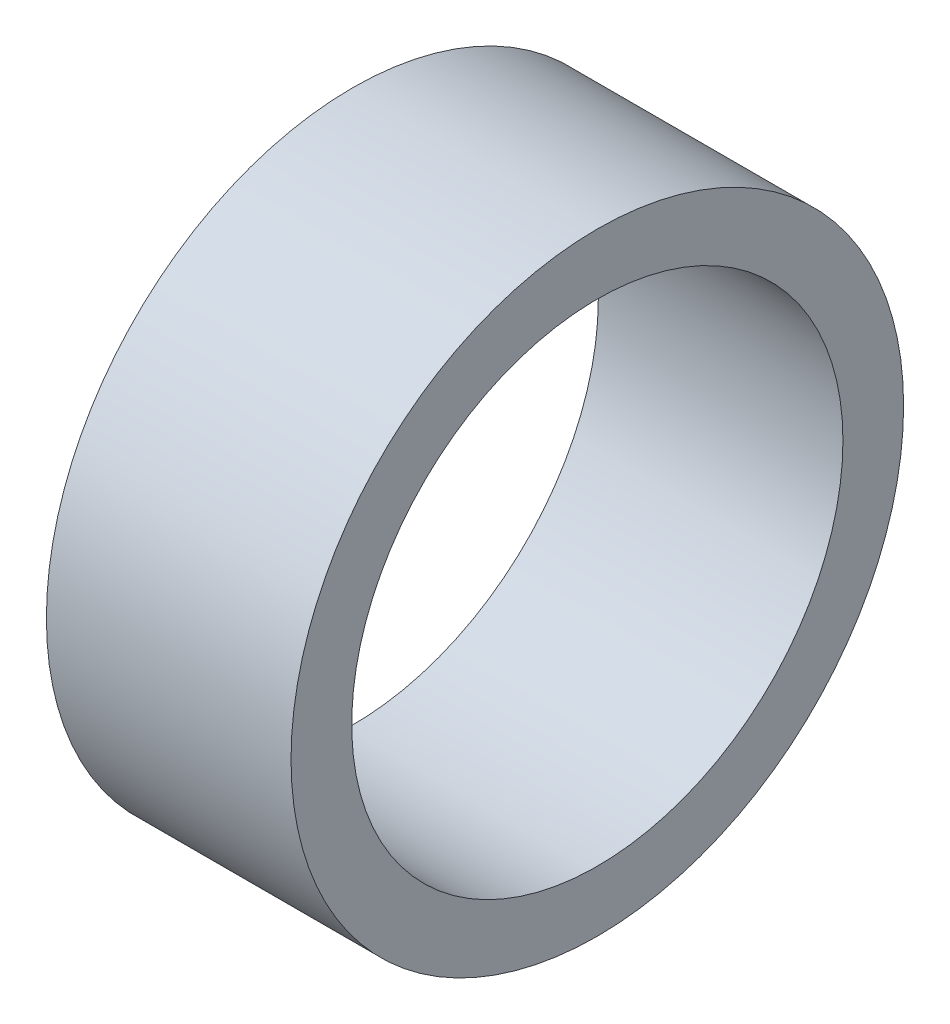
ISO-10303-21;
HEADER;
FILE_DESCRIPTION(('STEP AP214'),'2;1');
FILE_NAME('part.step','',(''),(''),'','','');
FILE_SCHEMA(('AUTOMOTIVE_DESIGN { 1 0 10303 214 1 1 1 1 }'));
ENDSEC;
DATA;
#1=APPLICATION_CONTEXT('core data for automotive mechanical design processes');
#2=APPLICATION_PROTOCOL_DEFINITION('international standard','automotive_design',2000,#1);
#3=PRODUCT_CONTEXT('',#1,'mechanical');
#4=PRODUCT('Part','Part','',(#3));
#5=PRODUCT_RELATED_PRODUCT_CATEGORY('part','',(#4));
#6=PRODUCT_DEFINITION_FORMATION('','',#4);
#7=PRODUCT_DEFINITION_CONTEXT('part definition',#1,'design');
#8=PRODUCT_DEFINITION('design','',#6,#7);
#9=PRODUCT_DEFINITION_SHAPE('','',#8);
#10=(LENGTH_UNIT() NAMED_UNIT(*) SI_UNIT(.MILLI.,.METRE.));
#11=(NAMED_UNIT(*) PLANE_ANGLE_UNIT() SI_UNIT($,.RADIAN.));
#12=(NAMED_UNIT(*) SI_UNIT($,.STERADIAN.) SOLID_ANGLE_UNIT());
#13=UNCERTAINTY_MEASURE_WITH_UNIT(LENGTH_MEASURE(1.E-05),#10,'distance_accuracy_value','');
#14=(GEOMETRIC_REPRESENTATION_CONTEXT(3) GLOBAL_UNCERTAINTY_ASSIGNED_CONTEXT((#13)) GLOBAL_UNIT_ASSIGNED_CONTEXT((#10,
#11,#12)) REPRESENTATION_CONTEXT('',''));
#15=CARTESIAN_POINT('',(0.,0.,0.));
#16=DIRECTION('',(0.,0.,1.));
#17=DIRECTION('',(1.,0.,0.));
#18=AXIS2_PLACEMENT_3D('',#15,#16,#17);
#19=CARTESIAN_POINT('',(1.5875,0.,0.));
#20=DIRECTION('',(1.,0.,0.));
#21=DIRECTION('',(0.,0.,-1.));
#22=AXIS2_PLACEMENT_3D('',#19,#20,#21);
#23=PLANE('',#22);
#24=CARTESIAN_POINT('',(1.5875,0.,0.));
#25=DIRECTION('',(1.,0.,0.));
#26=DIRECTION('',(0.,0.,-1.));
#27=AXIS2_PLACEMENT_3D('',#24,#25,#26);
#28=CIRCLE('',#27,3.9751);
#29=CARTESIAN_POINT('',(1.5875,0.,-3.9751));
#30=VERTEX_POINT('',#29);
#31=EDGE_CURVE('E10',#30,#30,#28,.T.);
#32=ORIENTED_EDGE('',*,*,#31,.T.);
#33=EDGE_LOOP('',(#32));
#34=FACE_BOUND('',#33,.T.);
#35=CARTESIAN_POINT('',(1.5875,0.,0.));
#36=DIRECTION('',(1.,0.,0.));
#37=DIRECTION('',(0.,0.,-1.));
#38=AXIS2_PLACEMENT_3D('',#35,#36,#37);
#39=CIRCLE('',#38,3.1877);
#40=CARTESIAN_POINT('',(1.5875,0.,-3.1877));
#41=VERTEX_POINT('',#40);
#42=EDGE_CURVE('E55',#41,#41,#39,.T.);
#43=ORIENTED_EDGE('',*,*,#42,.F.);
#44=EDGE_LOOP('',(#43));
#45=FACE_BOUND('',#44,.T.);
#46=ADVANCED_FACE('F41',(#34,#45),#23,.T.);
#47=CARTESIAN_POINT('',(-1.5875,0.,0.));
#48=DIRECTION('',(1.,0.,0.));
#49=DIRECTION('',(0.,0.,-1.));
#50=AXIS2_PLACEMENT_3D('',#47,#48,#49);
#51=PLANE('',#50);
#52=CARTESIAN_POINT('',(-1.5875,0.,0.));
#53=DIRECTION('',(1.,0.,0.));
#54=DIRECTION('',(0.,0.,-1.));
#55=AXIS2_PLACEMENT_3D('',#52,#53,#54);
#56=CIRCLE('',#55,3.9751);
#57=CARTESIAN_POINT('',(-1.5875,0.,-3.9751));
#58=VERTEX_POINT('',#57);
#59=EDGE_CURVE('E45',#58,#58,#56,.T.);
#60=ORIENTED_EDGE('',*,*,#59,.F.);
#61=EDGE_LOOP('',(#60));
#62=FACE_BOUND('',#61,.T.);
#63=CARTESIAN_POINT('',(-1.5875,0.,0.));
#64=DIRECTION('',(1.,0.,0.));
#65=DIRECTION('',(0.,0.,-1.));
#66=AXIS2_PLACEMENT_3D('',#63,#64,#65);
#67=CIRCLE('',#66,3.1877);
#68=CARTESIAN_POINT('',(-1.5875,0.,-3.1877));
#69=VERTEX_POINT('',#68);
#70=EDGE_CURVE('E57',#69,#69,#67,.T.);
#71=ORIENTED_EDGE('',*,*,#70,.T.);
#72=EDGE_LOOP('',(#71));
#73=FACE_BOUND('',#72,.T.);
#74=ADVANCED_FACE('F70',(#62,#73),#51,.F.);
#75=CARTESIAN_POINT('',(1.5875,0.,0.));
#76=DIRECTION('',(-1.,0.,0.));
#77=DIRECTION('',(0.,0.,1.));
#78=AXIS2_PLACEMENT_3D('',#75,#76,#77);
#79=CYLINDRICAL_SURFACE('',#78,3.9751);
#80=ORIENTED_EDGE('',*,*,#31,.F.);
#81=EDGE_LOOP('',(#80));
#82=FACE_BOUND('',#81,.T.);
#83=ORIENTED_EDGE('',*,*,#59,.T.);
#84=EDGE_LOOP('',(#83));
#85=FACE_BOUND('',#84,.T.);
#86=ADVANCED_FACE('F43',(#82,#85),#79,.T.);
#87=CARTESIAN_POINT('',(1.5875,0.,0.));
#88=DIRECTION('',(-1.,0.,0.));
#89=DIRECTION('',(0.,0.,1.));
#90=AXIS2_PLACEMENT_3D('',#87,#88,#89);
#91=CYLINDRICAL_SURFACE('',#90,3.1877);
#92=ORIENTED_EDGE('',*,*,#42,.T.);
#93=EDGE_LOOP('',(#92));
#94=FACE_BOUND('',#93,.T.);
#95=ORIENTED_EDGE('',*,*,#70,.F.);
#96=EDGE_LOOP('',(#95));
#97=FACE_BOUND('',#96,.T.);
#98=ADVANCED_FACE('F66',(#94,#97),#91,.F.);
#99=CLOSED_SHELL('',(#46,#74,#86,#98));
#100=MANIFOLD_SOLID_BREP('B2',#99);
#101=ADVANCED_BREP_SHAPE_REPRESENTATION('',(#18,#100),#14);
#102=SHAPE_DEFINITION_REPRESENTATION(#9,#101);
ENDSEC;
END-ISO-10303-21;
